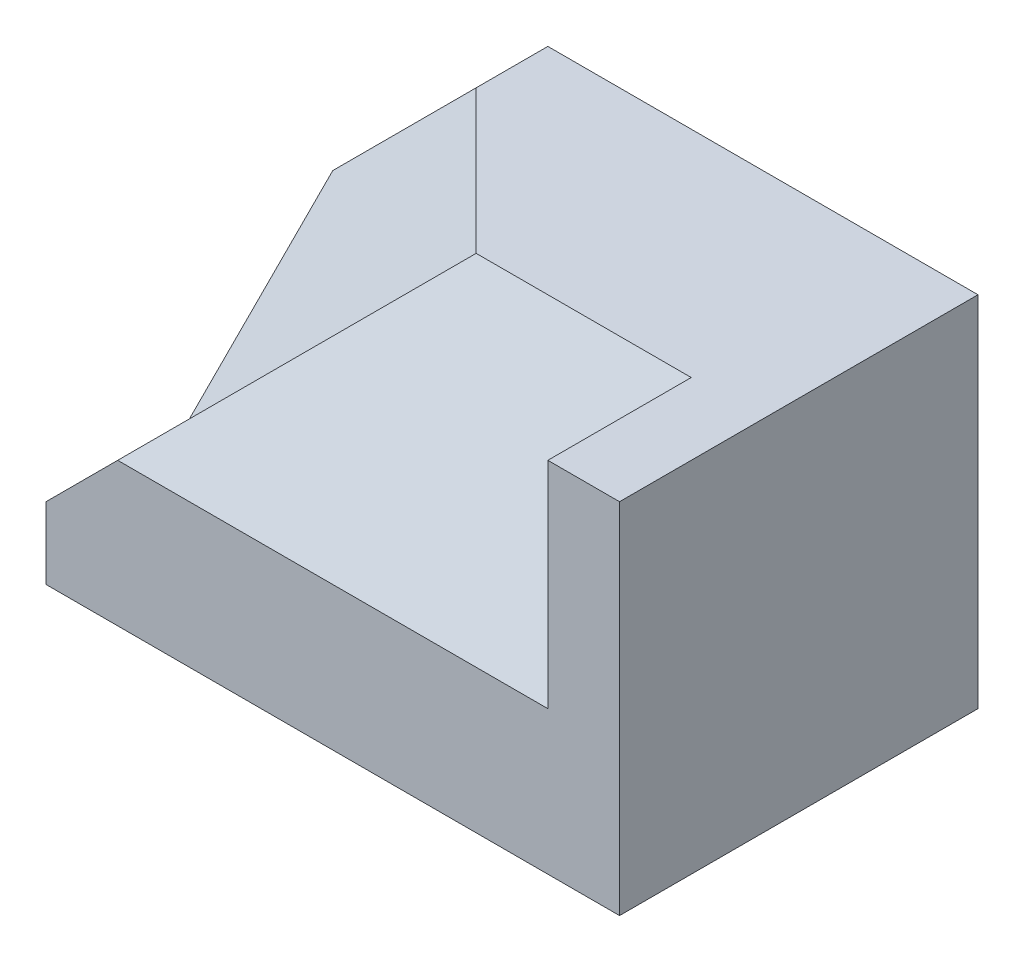
ISO-10303-21;
HEADER;
FILE_DESCRIPTION(('STEP AP214'),'2;1');
FILE_NAME('part.step','',(''),(''),'','','');
FILE_SCHEMA(('AUTOMOTIVE_DESIGN { 1 0 10303 214 1 1 1 1 }'));
ENDSEC;
DATA;
#1=APPLICATION_CONTEXT('core data for automotive mechanical design processes');
#2=APPLICATION_PROTOCOL_DEFINITION('international standard','automotive_design',2000,#1);
#3=PRODUCT_CONTEXT('',#1,'mechanical');
#4=PRODUCT('Part','Part','',(#3));
#5=PRODUCT_RELATED_PRODUCT_CATEGORY('part','',(#4));
#6=PRODUCT_DEFINITION_FORMATION('','',#4);
#7=PRODUCT_DEFINITION_CONTEXT('part definition',#1,'design');
#8=PRODUCT_DEFINITION('design','',#6,#7);
#9=PRODUCT_DEFINITION_SHAPE('','',#8);
#10=(LENGTH_UNIT() NAMED_UNIT(*) SI_UNIT(.MILLI.,.METRE.));
#11=(NAMED_UNIT(*) PLANE_ANGLE_UNIT() SI_UNIT($,.RADIAN.));
#12=(NAMED_UNIT(*) SI_UNIT($,.STERADIAN.) SOLID_ANGLE_UNIT());
#13=UNCERTAINTY_MEASURE_WITH_UNIT(LENGTH_MEASURE(1.E-05),#10,'distance_accuracy_value','');
#14=(GEOMETRIC_REPRESENTATION_CONTEXT(3) GLOBAL_UNCERTAINTY_ASSIGNED_CONTEXT((#13)) GLOBAL_UNIT_ASSIGNED_CONTEXT((#10,
#11,#12)) REPRESENTATION_CONTEXT('',''));
#15=CARTESIAN_POINT('',(0.,0.,0.));
#16=DIRECTION('',(0.,0.,1.));
#17=DIRECTION('',(1.,0.,0.));
#18=AXIS2_PLACEMENT_3D('',#15,#16,#17);
#19=CARTESIAN_POINT('',(-2.,2.5,3.));
#20=DIRECTION('',(0.,-1.,0.));
#21=DIRECTION('',(0.,0.,-1.));
#22=AXIS2_PLACEMENT_3D('',#19,#20,#21);
#23=PLANE('',#22);
#24=DIRECTION('',(0.,0.,-1.));
#25=VECTOR('',#24,1.);
#26=CARTESIAN_POINT('',(3.,2.5,3.));
#27=LINE('',#26,#25);
#28=CARTESIAN_POINT('',(3.,2.5,5.));
#29=VERTEX_POINT('',#28);
#30=CARTESIAN_POINT('',(3.,2.5,3.));
#31=VERTEX_POINT('',#30);
#32=EDGE_CURVE('E145',#29,#31,#27,.T.);
#33=ORIENTED_EDGE('',*,*,#32,.F.);
#34=DIRECTION('',(-1.,0.,0.));
#35=VECTOR('',#34,1.);
#36=CARTESIAN_POINT('',(4.,2.5,5.));
#37=LINE('',#36,#35);
#38=CARTESIAN_POINT('',(4.,2.5,5.));
#39=VERTEX_POINT('',#38);
#40=EDGE_CURVE('E38',#39,#29,#37,.T.);
#41=ORIENTED_EDGE('',*,*,#40,.F.);
#42=DIRECTION('',(0.,0.,-1.));
#43=VECTOR('',#42,1.);
#44=CARTESIAN_POINT('',(4.,2.5,3.));
#45=LINE('',#44,#43);
#46=CARTESIAN_POINT('',(4.,2.5,0.));
#47=VERTEX_POINT('',#46);
#48=EDGE_CURVE('E188',#39,#47,#45,.T.);
#49=ORIENTED_EDGE('',*,*,#48,.T.);
#50=DIRECTION('',(-1.,0.,0.));
#51=VECTOR('',#50,1.);
#52=CARTESIAN_POINT('',(-2.,2.5,0.));
#53=LINE('',#52,#51);
#54=CARTESIAN_POINT('',(-2.,2.5,0.));
#55=VERTEX_POINT('',#54);
#56=EDGE_CURVE('E105',#47,#55,#53,.T.);
#57=ORIENTED_EDGE('',*,*,#56,.T.);
#58=DIRECTION('',(0.,0.,-1.));
#59=VECTOR('',#58,1.);
#60=CARTESIAN_POINT('',(-2.,2.5,3.));
#61=LINE('',#60,#59);
#62=CARTESIAN_POINT('',(-2.,2.5,1.));
#63=VERTEX_POINT('',#62);
#64=EDGE_CURVE('E98',#63,#55,#61,.T.);
#65=ORIENTED_EDGE('',*,*,#64,.F.);
#66=DIRECTION('',(-0.707106781186548,0.,-0.707106781186548));
#67=VECTOR('',#66,1.);
#68=CARTESIAN_POINT('',(0.,2.5,3.));
#69=LINE('',#68,#67);
#70=CARTESIAN_POINT('',(0.,2.5,3.));
#71=VERTEX_POINT('',#70);
#72=EDGE_CURVE('E12',#71,#63,#69,.T.);
#73=ORIENTED_EDGE('',*,*,#72,.F.);
#74=DIRECTION('',(1.,0.,0.));
#75=VECTOR('',#74,1.);
#76=CARTESIAN_POINT('',(0.,2.5,3.));
#77=LINE('',#76,#75);
#78=EDGE_CURVE('E149',#71,#31,#77,.T.);
#79=ORIENTED_EDGE('',*,*,#78,.T.);
#80=EDGE_LOOP('',(#33,#41,#49,#57,#65,#73,#79));
#81=FACE_BOUND('',#80,.T.);
#82=ADVANCED_FACE('F35',(#81),#23,.F.);
#83=CARTESIAN_POINT('',(-4.,0.5,3.));
#84=DIRECTION('',(0.707106781186547,-0.707106781186547,0.));
#85=DIRECTION('',(0.707106781186548,0.707106781186548,0.));
#86=AXIS2_PLACEMENT_3D('',#83,#84,#85);
#87=PLANE('',#86);
#88=DIRECTION('',(0.707106781186548,0.707106781186548,0.));
#89=VECTOR('',#88,1.);
#90=CARTESIAN_POINT('',(-4.,0.5,1.));
#91=LINE('',#90,#89);
#92=CARTESIAN_POINT('',(-4.,0.5,1.));
#93=VERTEX_POINT('',#92);
#94=EDGE_CURVE('E88',#93,#63,#91,.T.);
#95=ORIENTED_EDGE('',*,*,#94,.T.);
#96=ORIENTED_EDGE('',*,*,#64,.T.);
#97=DIRECTION('',(-0.707106781186548,-0.707106781186548,0.));
#98=VECTOR('',#97,1.);
#99=CARTESIAN_POINT('',(-4.,0.5,0.));
#100=LINE('',#99,#98);
#101=CARTESIAN_POINT('',(-4.,0.5,0.));
#102=VERTEX_POINT('',#101);
#103=EDGE_CURVE('E107',#55,#102,#100,.T.);
#104=ORIENTED_EDGE('',*,*,#103,.T.);
#105=DIRECTION('',(0.,0.,-1.));
#106=VECTOR('',#105,1.);
#107=CARTESIAN_POINT('',(-4.,0.5,3.));
#108=LINE('',#107,#106);
#109=EDGE_CURVE('E100',#93,#102,#108,.T.);
#110=ORIENTED_EDGE('',*,*,#109,.F.);
#111=EDGE_LOOP('',(#95,#96,#104,#110));
#112=FACE_BOUND('',#111,.T.);
#113=ADVANCED_FACE('F96',(#112),#87,.F.);
#114=CARTESIAN_POINT('',(-4.,-2.5,3.));
#115=DIRECTION('',(1.,0.,0.));
#116=DIRECTION('',(0.,0.,-1.));
#117=AXIS2_PLACEMENT_3D('',#114,#115,#116);
#118=PLANE('',#117);
#119=DIRECTION('',(0.,0.707106781186548,-0.707106781186548));
#120=VECTOR('',#119,1.);
#121=CARTESIAN_POINT('',(-4.,-1.5,3.));
#122=LINE('',#121,#120);
#123=CARTESIAN_POINT('',(-4.,-1.5,3.));
#124=VERTEX_POINT('',#123);
#125=EDGE_CURVE('E109',#124,#93,#122,.T.);
#126=ORIENTED_EDGE('',*,*,#125,.T.);
#127=ORIENTED_EDGE('',*,*,#109,.T.);
#128=DIRECTION('',(0.,-1.,0.));
#129=VECTOR('',#128,1.);
#130=CARTESIAN_POINT('',(-4.,-2.5,0.));
#131=LINE('',#130,#129);
#132=CARTESIAN_POINT('',(-4.,-2.5,0.));
#133=VERTEX_POINT('',#132);
#134=EDGE_CURVE('E201',#102,#133,#131,.T.);
#135=ORIENTED_EDGE('',*,*,#134,.T.);
#136=DIRECTION('',(0.,0.,-1.));
#137=VECTOR('',#136,1.);
#138=CARTESIAN_POINT('',(-4.,-2.5,3.));
#139=LINE('',#138,#137);
#140=CARTESIAN_POINT('',(-4.,-2.5,5.));
#141=VERTEX_POINT('',#140);
#142=EDGE_CURVE('E44',#141,#133,#139,.T.);
#143=ORIENTED_EDGE('',*,*,#142,.F.);
#144=DIRECTION('',(0.,-1.,0.));
#145=VECTOR('',#144,1.);
#146=CARTESIAN_POINT('',(-4.,-1.5,5.));
#147=LINE('',#146,#145);
#148=CARTESIAN_POINT('',(-4.,-1.5,5.));
#149=VERTEX_POINT('',#148);
#150=EDGE_CURVE('E127',#149,#141,#147,.T.);
#151=ORIENTED_EDGE('',*,*,#150,.F.);
#152=DIRECTION('',(0.,0.,-1.));
#153=VECTOR('',#152,1.);
#154=CARTESIAN_POINT('',(-4.,-1.5,5.));
#155=LINE('',#154,#153);
#156=EDGE_CURVE('E101',#149,#124,#155,.T.);
#157=ORIENTED_EDGE('',*,*,#156,.T.);
#158=EDGE_LOOP('',(#126,#127,#135,#143,#151,#157));
#159=FACE_BOUND('',#158,.T.);
#160=ADVANCED_FACE('F233',(#159),#118,.F.);
#161=CARTESIAN_POINT('',(4.,-2.5,3.));
#162=DIRECTION('',(-1.,0.,0.));
#163=DIRECTION('',(0.,0.,1.));
#164=AXIS2_PLACEMENT_3D('',#161,#162,#163);
#165=PLANE('',#164);
#166=DIRECTION('',(0.,1.,0.));
#167=VECTOR('',#166,1.);
#168=CARTESIAN_POINT('',(4.,-2.5,0.));
#169=LINE('',#168,#167);
#170=CARTESIAN_POINT('',(4.,-2.5,0.));
#171=VERTEX_POINT('',#170);
#172=EDGE_CURVE('E194',#171,#47,#169,.T.);
#173=ORIENTED_EDGE('',*,*,#172,.T.);
#174=ORIENTED_EDGE('',*,*,#48,.F.);
#175=DIRECTION('',(0.,1.,0.));
#176=VECTOR('',#175,1.);
#177=CARTESIAN_POINT('',(4.,-2.5,5.));
#178=LINE('',#177,#176);
#179=CARTESIAN_POINT('',(4.,-2.5,5.));
#180=VERTEX_POINT('',#179);
#181=EDGE_CURVE('E139',#180,#39,#178,.T.);
#182=ORIENTED_EDGE('',*,*,#181,.F.);
#183=DIRECTION('',(0.,0.,-1.));
#184=VECTOR('',#183,1.);
#185=CARTESIAN_POINT('',(4.,-2.5,3.));
#186=LINE('',#185,#184);
#187=EDGE_CURVE('E191',#180,#171,#186,.T.);
#188=ORIENTED_EDGE('',*,*,#187,.T.);
#189=EDGE_LOOP('',(#173,#174,#182,#188));
#190=FACE_BOUND('',#189,.T.);
#191=ADVANCED_FACE('F195',(#190),#165,.F.);
#192=CARTESIAN_POINT('',(-4.,-2.5,3.));
#193=DIRECTION('',(0.,1.,0.));
#194=DIRECTION('',(0.,0.,1.));
#195=AXIS2_PLACEMENT_3D('',#192,#193,#194);
#196=PLANE('',#195);
#197=DIRECTION('',(1.,0.,0.));
#198=VECTOR('',#197,1.);
#199=CARTESIAN_POINT('',(-4.,-2.5,0.));
#200=LINE('',#199,#198);
#201=EDGE_CURVE('E216',#133,#171,#200,.T.);
#202=ORIENTED_EDGE('',*,*,#201,.T.);
#203=ORIENTED_EDGE('',*,*,#187,.F.);
#204=DIRECTION('',(1.,0.,0.));
#205=VECTOR('',#204,1.);
#206=CARTESIAN_POINT('',(-4.,-2.5,5.));
#207=LINE('',#206,#205);
#208=EDGE_CURVE('E114',#141,#180,#207,.T.);
#209=ORIENTED_EDGE('',*,*,#208,.F.);
#210=ORIENTED_EDGE('',*,*,#142,.T.);
#211=EDGE_LOOP('',(#202,#203,#209,#210));
#212=FACE_BOUND('',#211,.T.);
#213=ADVANCED_FACE('F219',(#212),#196,.F.);
#214=CARTESIAN_POINT('',(0.,0.,0.));
#215=DIRECTION('',(0.,0.,-1.));
#216=DIRECTION('',(-1.,0.,0.));
#217=AXIS2_PLACEMENT_3D('',#214,#215,#216);
#218=PLANE('',#217);
#219=ORIENTED_EDGE('',*,*,#172,.F.);
#220=ORIENTED_EDGE('',*,*,#201,.F.);
#221=ORIENTED_EDGE('',*,*,#134,.F.);
#222=ORIENTED_EDGE('',*,*,#103,.F.);
#223=ORIENTED_EDGE('',*,*,#56,.F.);
#224=EDGE_LOOP('',(#219,#220,#221,#222,#223));
#225=FACE_BOUND('',#224,.T.);
#226=ADVANCED_FACE('F220',(#225),#218,.T.);
#227=CARTESIAN_POINT('',(-1.83333333333333,1.83333333333333,1.83333333333334));
#228=DIRECTION('',(-0.577350269189625,0.577350269189626,0.577350269189627));
#229=DIRECTION('',(0.,-0.707106781186548,0.707106781186547));
#230=AXIS2_PLACEMENT_3D('',#227,#228,#229);
#231=PLANE('',#230);
#232=DIRECTION('',(-0.707106781186548,-0.707106781186548,0.));
#233=VECTOR('',#232,1.);
#234=CARTESIAN_POINT('',(0.,2.5,3.));
#235=LINE('',#234,#233);
#236=EDGE_CURVE('E61',#71,#124,#235,.T.);
#237=ORIENTED_EDGE('',*,*,#236,.F.);
#238=ORIENTED_EDGE('',*,*,#72,.T.);
#239=ORIENTED_EDGE('',*,*,#94,.F.);
#240=ORIENTED_EDGE('',*,*,#125,.F.);
#241=EDGE_LOOP('',(#237,#238,#239,#240));
#242=FACE_BOUND('',#241,.T.);
#243=ADVANCED_FACE('F87',(#242),#231,.T.);
#244=CARTESIAN_POINT('',(-3.,-0.500000000000001,5.));
#245=DIRECTION('',(0.707106781186548,-0.707106781186547,0.));
#246=DIRECTION('',(0.707106781186547,0.707106781186548,0.));
#247=AXIS2_PLACEMENT_3D('',#244,#245,#246);
#248=PLANE('',#247);
#249=DIRECTION('',(-0.707106781186547,-0.707106781186548,0.));
#250=VECTOR('',#249,1.);
#251=CARTESIAN_POINT('',(-3.,-0.500000000000001,5.));
#252=LINE('',#251,#250);
#253=CARTESIAN_POINT('',(-3.,-0.500000000000001,5.));
#254=VERTEX_POINT('',#253);
#255=EDGE_CURVE('E133',#254,#149,#252,.T.);
#256=ORIENTED_EDGE('',*,*,#255,.F.);
#257=DIRECTION('',(0.639602149066831,0.639602149066831,-0.426401432711221));
#258=VECTOR('',#257,1.);
#259=CARTESIAN_POINT('',(-3.,-0.500000000000001,5.));
#260=LINE('',#259,#258);
#261=EDGE_CURVE('E141',#254,#71,#260,.T.);
#262=ORIENTED_EDGE('',*,*,#261,.T.);
#263=ORIENTED_EDGE('',*,*,#236,.T.);
#264=ORIENTED_EDGE('',*,*,#156,.F.);
#265=EDGE_LOOP('',(#256,#262,#263,#264));
#266=FACE_BOUND('',#265,.T.);
#267=ADVANCED_FACE('F176',(#266),#248,.F.);
#268=CARTESIAN_POINT('',(0.,0.,5.));
#269=DIRECTION('',(0.,0.,1.));
#270=DIRECTION('',(1.,0.,0.));
#271=AXIS2_PLACEMENT_3D('',#268,#269,#270);
#272=PLANE('',#271);
#273=DIRECTION('',(-1.,0.,0.));
#274=VECTOR('',#273,1.);
#275=CARTESIAN_POINT('',(3.,-0.5,5.));
#276=LINE('',#275,#274);
#277=CARTESIAN_POINT('',(3.,-0.5,5.));
#278=VERTEX_POINT('',#277);
#279=EDGE_CURVE('E152',#278,#254,#276,.T.);
#280=ORIENTED_EDGE('',*,*,#279,.T.);
#281=ORIENTED_EDGE('',*,*,#255,.T.);
#282=ORIENTED_EDGE('',*,*,#150,.T.);
#283=ORIENTED_EDGE('',*,*,#208,.T.);
#284=ORIENTED_EDGE('',*,*,#181,.T.);
#285=ORIENTED_EDGE('',*,*,#40,.T.);
#286=DIRECTION('',(0.,1.,0.));
#287=VECTOR('',#286,1.);
#288=CARTESIAN_POINT('',(3.,-0.5,5.));
#289=LINE('',#288,#287);
#290=EDGE_CURVE('E155',#278,#29,#289,.T.);
#291=ORIENTED_EDGE('',*,*,#290,.F.);
#292=EDGE_LOOP('',(#280,#281,#282,#283,#284,#285,#291));
#293=FACE_BOUND('',#292,.T.);
#294=ADVANCED_FACE('F180',(#293),#272,.T.);
#295=CARTESIAN_POINT('',(0.,2.15384615384615,3.23076923076923));
#296=DIRECTION('',(0.,-0.554700196225229,-0.832050294337844));
#297=DIRECTION('',(0.,0.832050294337844,-0.554700196225229));
#298=AXIS2_PLACEMENT_3D('',#295,#296,#297);
#299=PLANE('',#298);
#300=ORIENTED_EDGE('',*,*,#279,.F.);
#301=DIRECTION('',(0.,-0.832050294337844,0.554700196225229));
#302=VECTOR('',#301,1.);
#303=CARTESIAN_POINT('',(3.,2.5,3.));
#304=LINE('',#303,#302);
#305=EDGE_CURVE('E52',#31,#278,#304,.T.);
#306=ORIENTED_EDGE('',*,*,#305,.F.);
#307=ORIENTED_EDGE('',*,*,#78,.F.);
#308=ORIENTED_EDGE('',*,*,#261,.F.);
#309=EDGE_LOOP('',(#300,#306,#307,#308));
#310=FACE_BOUND('',#309,.T.);
#311=ADVANCED_FACE('F173',(#310),#299,.F.);
#312=CARTESIAN_POINT('',(3.,2.5,3.));
#313=DIRECTION('',(-1.,0.,0.));
#314=DIRECTION('',(0.,0.,1.));
#315=AXIS2_PLACEMENT_3D('',#312,#313,#314);
#316=PLANE('',#315);
#317=ORIENTED_EDGE('',*,*,#32,.T.);
#318=ORIENTED_EDGE('',*,*,#305,.T.);
#319=ORIENTED_EDGE('',*,*,#290,.T.);
#320=EDGE_LOOP('',(#317,#318,#319));
#321=FACE_BOUND('',#320,.T.);
#322=ADVANCED_FACE('F187',(#321),#316,.T.);
#323=CLOSED_SHELL('',(#82,#113,#160,#191,#213,#226,#243,#267,#294,#311,#322));
#324=MANIFOLD_SOLID_BREP('B2',#323);
#325=ADVANCED_BREP_SHAPE_REPRESENTATION('',(#18,#324),#14);
#326=SHAPE_DEFINITION_REPRESENTATION(#9,#325);
ENDSEC;
END-ISO-10303-21;
